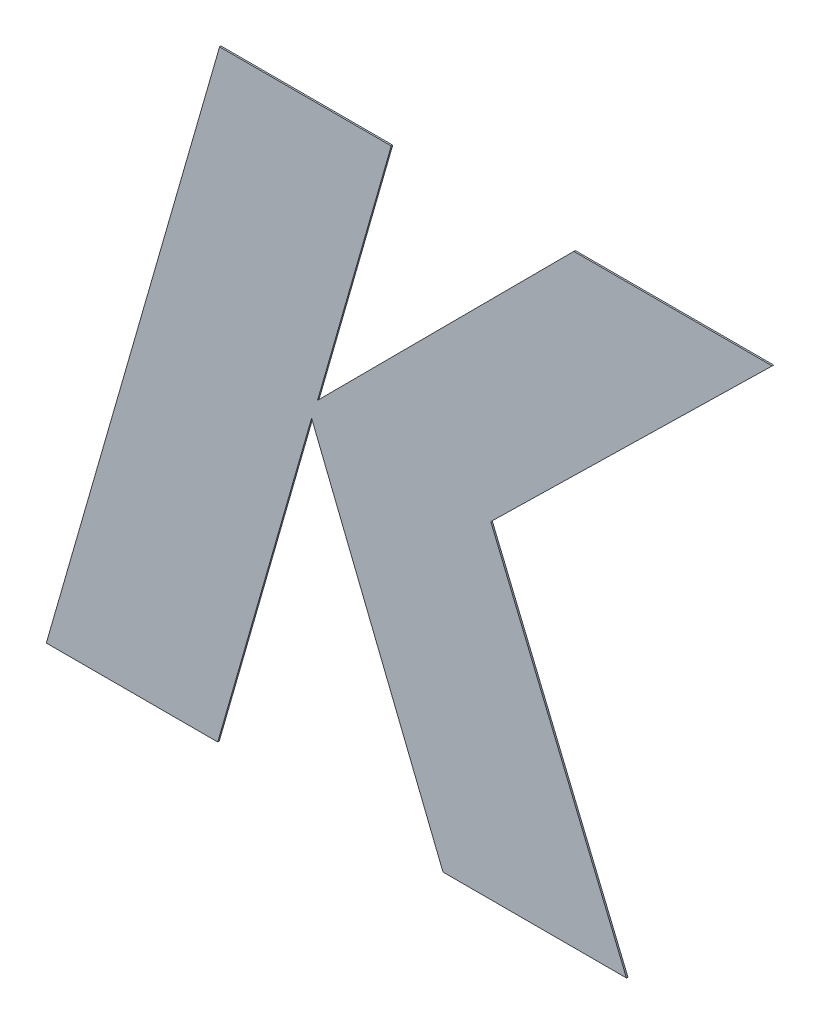
ISO-10303-21;
HEADER;
FILE_DESCRIPTION(('STEP AP214'),'2;1');
FILE_NAME('part.step','',(''),(''),'','','');
FILE_SCHEMA(('AUTOMOTIVE_DESIGN { 1 0 10303 214 1 1 1 1 }'));
ENDSEC;
DATA;
#1=APPLICATION_CONTEXT('core data for automotive mechanical design processes');
#2=APPLICATION_PROTOCOL_DEFINITION('international standard','automotive_design',2000,#1);
#3=PRODUCT_CONTEXT('',#1,'mechanical');
#4=PRODUCT('Part','Part','',(#3));
#5=PRODUCT_RELATED_PRODUCT_CATEGORY('part','',(#4));
#6=PRODUCT_DEFINITION_FORMATION('','',#4);
#7=PRODUCT_DEFINITION_CONTEXT('part definition',#1,'design');
#8=PRODUCT_DEFINITION('design','',#6,#7);
#9=PRODUCT_DEFINITION_SHAPE('','',#8);
#10=(LENGTH_UNIT() NAMED_UNIT(*) SI_UNIT(.MILLI.,.METRE.));
#11=(NAMED_UNIT(*) PLANE_ANGLE_UNIT() SI_UNIT($,.RADIAN.));
#12=(NAMED_UNIT(*) SI_UNIT($,.STERADIAN.) SOLID_ANGLE_UNIT());
#13=UNCERTAINTY_MEASURE_WITH_UNIT(LENGTH_MEASURE(1.E-05),#10,'distance_accuracy_value','');
#14=(GEOMETRIC_REPRESENTATION_CONTEXT(3) GLOBAL_UNCERTAINTY_ASSIGNED_CONTEXT((#13)) GLOBAL_UNIT_ASSIGNED_CONTEXT((#10,
#11,#12)) REPRESENTATION_CONTEXT('',''));
#15=CARTESIAN_POINT('',(0.,0.,0.));
#16=DIRECTION('',(0.,0.,1.));
#17=DIRECTION('',(1.,0.,0.));
#18=AXIS2_PLACEMENT_3D('',#15,#16,#17);
#19=CARTESIAN_POINT('',(3.91803,4.77633,5.205));
#20=DIRECTION('',(0.961099233431586,-0.276203301025201,0.));
#21=DIRECTION('',(0.,0.,-1.));
#22=AXIS2_PLACEMENT_3D('',#19,#20,#21);
#23=PLANE('',#22);
#24=DIRECTION('',(-0.276203301025201,-0.961099233431586,0.));
#25=VECTOR('',#24,1.);
#26=CARTESIAN_POINT('',(3.91803,4.77633,5.2));
#27=LINE('',#26,#25);
#28=CARTESIAN_POINT('',(4.5070939744564,6.82608440985244,5.2));
#29=VERTEX_POINT('',#28);
#30=CARTESIAN_POINT('',(3.91803,4.77633,5.2));
#31=VERTEX_POINT('',#30);
#32=EDGE_CURVE('E10',#29,#31,#27,.T.);
#33=ORIENTED_EDGE('',*,*,#32,.T.);
#34=DIRECTION('',(0.,0.,-1.));
#35=VECTOR('',#34,1.);
#36=CARTESIAN_POINT('',(3.91803,4.77633,5.205));
#37=LINE('',#36,#35);
#38=CARTESIAN_POINT('',(3.91803,4.77633,5.205));
#39=VERTEX_POINT('',#38);
#40=EDGE_CURVE('E42',#39,#31,#37,.T.);
#41=ORIENTED_EDGE('',*,*,#40,.F.);
#42=DIRECTION('',(-0.276203301025201,-0.961099233431586,0.));
#43=VECTOR('',#42,1.);
#44=CARTESIAN_POINT('',(3.91803,4.77633,5.205));
#45=LINE('',#44,#43);
#46=CARTESIAN_POINT('',(4.5070939744564,6.82608440985244,5.205));
#47=VERTEX_POINT('',#46);
#48=EDGE_CURVE('E135',#47,#39,#45,.T.);
#49=ORIENTED_EDGE('',*,*,#48,.F.);
#50=DIRECTION('',(0.,0.,-1.));
#51=VECTOR('',#50,1.);
#52=CARTESIAN_POINT('',(4.5070939744564,6.82608440985244,5.205));
#53=LINE('',#52,#51);
#54=EDGE_CURVE('E27',#47,#29,#53,.T.);
#55=ORIENTED_EDGE('',*,*,#54,.T.);
#56=EDGE_LOOP('',(#33,#41,#49,#55));
#57=FACE_BOUND('',#56,.T.);
#58=ADVANCED_FACE('F16',(#57),#23,.F.);
#59=CARTESIAN_POINT('',(4.50088641085166,4.77632999999994,5.205));
#60=DIRECTION('',(0.,1.,0.));
#61=DIRECTION('',(1.,0.,-1.10443527591038E-13));
#62=AXIS2_PLACEMENT_3D('',#59,#60,#61);
#63=PLANE('',#62);
#64=DIRECTION('',(1.,-1.10443527591038E-13,0.));
#65=VECTOR('',#64,1.);
#66=CARTESIAN_POINT('',(4.50088641085166,4.77632999999994,5.2));
#67=LINE('',#66,#65);
#68=CARTESIAN_POINT('',(4.50088641085166,4.77632999999994,5.2));
#69=VERTEX_POINT('',#68);
#70=EDGE_CURVE('E160',#31,#69,#67,.T.);
#71=ORIENTED_EDGE('',*,*,#70,.T.);
#72=DIRECTION('',(0.,0.,-1.));
#73=VECTOR('',#72,1.);
#74=CARTESIAN_POINT('',(4.50088641085166,4.77632999999994,5.205));
#75=LINE('',#74,#73);
#76=CARTESIAN_POINT('',(4.50088641085166,4.77632999999994,5.205));
#77=VERTEX_POINT('',#76);
#78=EDGE_CURVE('E149',#77,#69,#75,.T.);
#79=ORIENTED_EDGE('',*,*,#78,.F.);
#80=DIRECTION('',(1.,-1.10443527591038E-13,0.));
#81=VECTOR('',#80,1.);
#82=CARTESIAN_POINT('',(4.50088641085166,4.77632999999994,5.205));
#83=LINE('',#82,#81);
#84=EDGE_CURVE('E178',#39,#77,#83,.T.);
#85=ORIENTED_EDGE('',*,*,#84,.F.);
#86=ORIENTED_EDGE('',*,*,#40,.T.);
#87=EDGE_LOOP('',(#71,#79,#85,#86));
#88=FACE_BOUND('',#87,.T.);
#89=ADVANCED_FACE('F161',(#88),#63,.F.);
#90=CARTESIAN_POINT('',(4.81988404513849,5.88929101332706,5.205));
#91=DIRECTION('',(-0.961293454474758,0.275526576547503,0.));
#92=DIRECTION('',(0.,0.,1.));
#93=AXIS2_PLACEMENT_3D('',#90,#91,#92);
#94=PLANE('',#93);
#95=DIRECTION('',(0.275526576547503,0.961293454474758,0.));
#96=VECTOR('',#95,1.);
#97=CARTESIAN_POINT('',(4.81988404513849,5.88929101332706,5.2));
#98=LINE('',#97,#96);
#99=CARTESIAN_POINT('',(4.81988404513849,5.88929101332706,5.2));
#100=VERTEX_POINT('',#99);
#101=EDGE_CURVE('E153',#69,#100,#98,.T.);
#102=ORIENTED_EDGE('',*,*,#101,.T.);
#103=DIRECTION('',(0.,0.,-1.));
#104=VECTOR('',#103,1.);
#105=CARTESIAN_POINT('',(4.81988404513849,5.88929101332706,5.205));
#106=LINE('',#105,#104);
#107=CARTESIAN_POINT('',(4.81988404513849,5.88929101332706,5.205));
#108=VERTEX_POINT('',#107);
#109=EDGE_CURVE('E183',#108,#100,#106,.T.);
#110=ORIENTED_EDGE('',*,*,#109,.F.);
#111=DIRECTION('',(0.275526576547503,0.961293454474758,0.));
#112=VECTOR('',#111,1.);
#113=CARTESIAN_POINT('',(4.81988404513849,5.88929101332706,5.205));
#114=LINE('',#113,#112);
#115=EDGE_CURVE('E155',#77,#108,#114,.T.);
#116=ORIENTED_EDGE('',*,*,#115,.F.);
#117=ORIENTED_EDGE('',*,*,#78,.T.);
#118=EDGE_LOOP('',(#102,#110,#116,#117));
#119=FACE_BOUND('',#118,.T.);
#120=ADVANCED_FACE('F150',(#119),#94,.F.);
#121=CARTESIAN_POINT('',(5.26662283395568,4.77632999999994,5.205));
#122=DIRECTION('',(0.928029086213704,0.372507738364397,0.));
#123=DIRECTION('',(0.,0.,-1.));
#124=AXIS2_PLACEMENT_3D('',#121,#122,#123);
#125=PLANE('',#124);
#126=DIRECTION('',(0.372507738364397,-0.928029086213704,0.));
#127=VECTOR('',#126,1.);
#128=CARTESIAN_POINT('',(5.26662283395568,4.77632999999994,5.2));
#129=LINE('',#128,#127);
#130=CARTESIAN_POINT('',(5.26662283395568,4.77632999999994,5.2));
#131=VERTEX_POINT('',#130);
#132=EDGE_CURVE('E157',#100,#131,#129,.T.);
#133=ORIENTED_EDGE('',*,*,#132,.T.);
#134=DIRECTION('',(0.,0.,-1.));
#135=VECTOR('',#134,1.);
#136=CARTESIAN_POINT('',(5.26662283395568,4.77632999999994,5.205));
#137=LINE('',#136,#135);
#138=CARTESIAN_POINT('',(5.26662283395568,4.77632999999994,5.205));
#139=VERTEX_POINT('',#138);
#140=EDGE_CURVE('E184',#139,#131,#137,.T.);
#141=ORIENTED_EDGE('',*,*,#140,.F.);
#142=DIRECTION('',(0.372507738364397,-0.928029086213704,0.));
#143=VECTOR('',#142,1.);
#144=CARTESIAN_POINT('',(5.26662283395568,4.77632999999994,5.205));
#145=LINE('',#144,#143);
#146=EDGE_CURVE('E201',#108,#139,#145,.T.);
#147=ORIENTED_EDGE('',*,*,#146,.F.);
#148=ORIENTED_EDGE('',*,*,#109,.T.);
#149=EDGE_LOOP('',(#133,#141,#147,#148));
#150=FACE_BOUND('',#149,.T.);
#151=ADVANCED_FACE('F268',(#150),#125,.F.);
#152=CARTESIAN_POINT('',(5.89029583608144,4.77632999999994,5.205));
#153=DIRECTION('',(0.,1.,0.));
#154=DIRECTION('',(1.,0.,0.));
#155=AXIS2_PLACEMENT_3D('',#152,#153,#154);
#156=PLANE('',#155);
#157=DIRECTION('',(1.,0.,0.));
#158=VECTOR('',#157,1.);
#159=CARTESIAN_POINT('',(5.89029583608144,4.77632999999994,5.2));
#160=LINE('',#159,#158);
#161=CARTESIAN_POINT('',(5.89029583608144,4.77632999999994,5.2));
#162=VERTEX_POINT('',#161);
#163=EDGE_CURVE('E180',#131,#162,#160,.T.);
#164=ORIENTED_EDGE('',*,*,#163,.T.);
#165=DIRECTION('',(0.,0.,-1.));
#166=VECTOR('',#165,1.);
#167=CARTESIAN_POINT('',(5.89029583608144,4.77632999999994,5.205));
#168=LINE('',#167,#166);
#169=CARTESIAN_POINT('',(5.89029583608144,4.77632999999994,5.205));
#170=VERTEX_POINT('',#169);
#171=EDGE_CURVE('E226',#170,#162,#168,.T.);
#172=ORIENTED_EDGE('',*,*,#171,.F.);
#173=DIRECTION('',(1.,0.,0.));
#174=VECTOR('',#173,1.);
#175=CARTESIAN_POINT('',(5.89029583608144,4.77632999999994,5.205));
#176=LINE('',#175,#174);
#177=EDGE_CURVE('E198',#139,#170,#176,.T.);
#178=ORIENTED_EDGE('',*,*,#177,.F.);
#179=ORIENTED_EDGE('',*,*,#140,.T.);
#180=EDGE_LOOP('',(#164,#172,#178,#179));
#181=FACE_BOUND('',#180,.T.);
#182=ADVANCED_FACE('F18',(#181),#156,.F.);
#183=CARTESIAN_POINT('',(5.42896678366348,5.88929101332707,5.205));
#184=DIRECTION('',(-0.923783981403877,-0.382914031737676,0.));
#185=DIRECTION('',(-0.382914031737676,0.923783981403877,0.));
#186=AXIS2_PLACEMENT_3D('',#183,#184,#185);
#187=PLANE('',#186);
#188=DIRECTION('',(-0.382914031737676,0.923783981403877,0.));
#189=VECTOR('',#188,1.);
#190=CARTESIAN_POINT('',(5.42896678366348,5.88929101332707,5.2));
#191=LINE('',#190,#189);
#192=CARTESIAN_POINT('',(5.42896678366348,5.88929101332707,5.2));
#193=VERTEX_POINT('',#192);
#194=EDGE_CURVE('E197',#162,#193,#191,.T.);
#195=ORIENTED_EDGE('',*,*,#194,.T.);
#196=DIRECTION('',(0.,0.,-1.));
#197=VECTOR('',#196,1.);
#198=CARTESIAN_POINT('',(5.42896678366348,5.88929101332707,5.205));
#199=LINE('',#198,#197);
#200=CARTESIAN_POINT('',(5.42896678366348,5.88929101332707,5.205));
#201=VERTEX_POINT('',#200);
#202=EDGE_CURVE('E188',#201,#193,#199,.T.);
#203=ORIENTED_EDGE('',*,*,#202,.F.);
#204=DIRECTION('',(-0.382914031737676,0.923783981403877,0.));
#205=VECTOR('',#204,1.);
#206=CARTESIAN_POINT('',(5.42896678366348,5.88929101332707,5.205));
#207=LINE('',#206,#205);
#208=EDGE_CURVE('E108',#170,#201,#207,.T.);
#209=ORIENTED_EDGE('',*,*,#208,.F.);
#210=ORIENTED_EDGE('',*,*,#171,.T.);
#211=EDGE_LOOP('',(#195,#203,#209,#210));
#212=FACE_BOUND('',#211,.T.);
#213=ADVANCED_FACE('F376',(#212),#187,.F.);
#214=CARTESIAN_POINT('',(6.38585373580663,6.82608440985244,5.205));
#215=DIRECTION('',(-0.699564397226959,0.714569558638263,0.));
#216=DIRECTION('',(0.,0.,1.));
#217=AXIS2_PLACEMENT_3D('',#214,#215,#216);
#218=PLANE('',#217);
#219=DIRECTION('',(0.714569558638263,0.699564397226959,0.));
#220=VECTOR('',#219,1.);
#221=CARTESIAN_POINT('',(6.38585373580663,6.82608440985244,5.2));
#222=LINE('',#221,#220);
#223=CARTESIAN_POINT('',(6.38585373580663,6.82608440985244,5.2));
#224=VERTEX_POINT('',#223);
#225=EDGE_CURVE('E229',#193,#224,#222,.T.);
#226=ORIENTED_EDGE('',*,*,#225,.T.);
#227=DIRECTION('',(0.,0.,-1.));
#228=VECTOR('',#227,1.);
#229=CARTESIAN_POINT('',(6.38585373580663,6.82608440985244,5.205));
#230=LINE('',#229,#228);
#231=CARTESIAN_POINT('',(6.38585373580663,6.82608440985244,5.205));
#232=VERTEX_POINT('',#231);
#233=EDGE_CURVE('E123',#232,#224,#230,.T.);
#234=ORIENTED_EDGE('',*,*,#233,.F.);
#235=DIRECTION('',(0.714569558638263,0.699564397226959,0.));
#236=VECTOR('',#235,1.);
#237=CARTESIAN_POINT('',(6.38585373580663,6.82608440985244,5.205));
#238=LINE('',#237,#236);
#239=EDGE_CURVE('E20',#201,#232,#238,.T.);
#240=ORIENTED_EDGE('',*,*,#239,.F.);
#241=ORIENTED_EDGE('',*,*,#202,.T.);
#242=EDGE_LOOP('',(#226,#234,#240,#241));
#243=FACE_BOUND('',#242,.T.);
#244=ADVANCED_FACE('F371',(#243),#218,.F.);
#245=CARTESIAN_POINT('',(5.71129866959105,6.82608440985244,5.205));
#246=DIRECTION('',(0.,-1.,0.));
#247=DIRECTION('',(0.,0.,-1.));
#248=AXIS2_PLACEMENT_3D('',#245,#246,#247);
#249=PLANE('',#248);
#250=DIRECTION('',(-1.,0.,0.));
#251=VECTOR('',#250,1.);
#252=CARTESIAN_POINT('',(5.71129866959105,6.82608440985244,5.2));
#253=LINE('',#252,#251);
#254=CARTESIAN_POINT('',(5.71129866959105,6.82608440985244,5.2));
#255=VERTEX_POINT('',#254);
#256=EDGE_CURVE('E185',#224,#255,#253,.T.);
#257=ORIENTED_EDGE('',*,*,#256,.T.);
#258=DIRECTION('',(0.,0.,-1.));
#259=VECTOR('',#258,1.);
#260=CARTESIAN_POINT('',(5.71129866959105,6.82608440985244,5.205));
#261=LINE('',#260,#259);
#262=CARTESIAN_POINT('',(5.71129866959105,6.82608440985244,5.205));
#263=VERTEX_POINT('',#262);
#264=EDGE_CURVE('E222',#263,#255,#261,.T.);
#265=ORIENTED_EDGE('',*,*,#264,.F.);
#266=DIRECTION('',(-1.,0.,0.));
#267=VECTOR('',#266,1.);
#268=CARTESIAN_POINT('',(5.71129866959105,6.82608440985244,5.205));
#269=LINE('',#268,#267);
#270=EDGE_CURVE('E205',#232,#263,#269,.T.);
#271=ORIENTED_EDGE('',*,*,#270,.F.);
#272=ORIENTED_EDGE('',*,*,#233,.T.);
#273=EDGE_LOOP('',(#257,#265,#271,#272));
#274=FACE_BOUND('',#273,.T.);
#275=ADVANCED_FACE('F375',(#274),#249,.F.);
#276=CARTESIAN_POINT('',(4.84017080800069,5.95198988211872,5.205));
#277=DIRECTION('',(0.708307753494397,-0.70590376563645,0.));
#278=DIRECTION('',(0.,0.,-1.));
#279=AXIS2_PLACEMENT_3D('',#276,#277,#278);
#280=PLANE('',#279);
#281=DIRECTION('',(-0.70590376563645,-0.708307753494397,0.));
#282=VECTOR('',#281,1.);
#283=CARTESIAN_POINT('',(4.84017080800069,5.95198988211872,5.2));
#284=LINE('',#283,#282);
#285=CARTESIAN_POINT('',(4.84017080800069,5.95198988211872,5.2));
#286=VERTEX_POINT('',#285);
#287=EDGE_CURVE('E204',#255,#286,#284,.T.);
#288=ORIENTED_EDGE('',*,*,#287,.T.);
#289=DIRECTION('',(0.,0.,-1.));
#290=VECTOR('',#289,1.);
#291=CARTESIAN_POINT('',(4.84017080800069,5.95198988211872,5.205));
#292=LINE('',#291,#290);
#293=CARTESIAN_POINT('',(4.84017080800069,5.95198988211872,5.205));
#294=VERTEX_POINT('',#293);
#295=EDGE_CURVE('E212',#294,#286,#292,.T.);
#296=ORIENTED_EDGE('',*,*,#295,.F.);
#297=DIRECTION('',(-0.70590376563645,-0.708307753494397,0.));
#298=VECTOR('',#297,1.);
#299=CARTESIAN_POINT('',(4.84017080800069,5.95198988211872,5.205));
#300=LINE('',#299,#298);
#301=EDGE_CURVE('E193',#263,#294,#300,.T.);
#302=ORIENTED_EDGE('',*,*,#301,.F.);
#303=ORIENTED_EDGE('',*,*,#264,.T.);
#304=EDGE_LOOP('',(#288,#296,#302,#303));
#305=FACE_BOUND('',#304,.T.);
#306=ADVANCED_FACE('F392',(#305),#280,.F.);
#307=CARTESIAN_POINT('',(5.09072944844473,6.82608440985244,5.205));
#308=DIRECTION('',(-0.961286149092731,0.27555206325206,0.));
#309=DIRECTION('',(0.,0.,1.));
#310=AXIS2_PLACEMENT_3D('',#307,#308,#309);
#311=PLANE('',#310);
#312=DIRECTION('',(0.27555206325206,0.961286149092731,0.));
#313=VECTOR('',#312,1.);
#314=CARTESIAN_POINT('',(5.09072944844473,6.82608440985244,5.2));
#315=LINE('',#314,#313);
#316=CARTESIAN_POINT('',(5.09072944844473,6.82608440985244,5.2));
#317=VERTEX_POINT('',#316);
#318=EDGE_CURVE('E215',#286,#317,#315,.T.);
#319=ORIENTED_EDGE('',*,*,#318,.T.);
#320=DIRECTION('',(0.,0.,-1.));
#321=VECTOR('',#320,1.);
#322=CARTESIAN_POINT('',(5.09072944844473,6.82608440985244,5.205));
#323=LINE('',#322,#321);
#324=CARTESIAN_POINT('',(5.09072944844473,6.82608440985244,5.205));
#325=VERTEX_POINT('',#324);
#326=EDGE_CURVE('E232',#325,#317,#323,.T.);
#327=ORIENTED_EDGE('',*,*,#326,.F.);
#328=DIRECTION('',(0.27555206325206,0.961286149092731,0.));
#329=VECTOR('',#328,1.);
#330=CARTESIAN_POINT('',(5.09072944844473,6.82608440985244,5.205));
#331=LINE('',#330,#329);
#332=EDGE_CURVE('E189',#294,#325,#331,.T.);
#333=ORIENTED_EDGE('',*,*,#332,.F.);
#334=ORIENTED_EDGE('',*,*,#295,.T.);
#335=EDGE_LOOP('',(#319,#327,#333,#334));
#336=FACE_BOUND('',#335,.T.);
#337=ADVANCED_FACE('F407',(#336),#311,.F.);
#338=CARTESIAN_POINT('',(4.5070939744564,6.82608440985244,5.205));
#339=DIRECTION('',(0.,-1.,0.));
#340=DIRECTION('',(0.,0.,-1.));
#341=AXIS2_PLACEMENT_3D('',#338,#339,#340);
#342=PLANE('',#341);
#343=DIRECTION('',(-1.,0.,0.));
#344=VECTOR('',#343,1.);
#345=CARTESIAN_POINT('',(4.5070939744564,6.82608440985244,5.2));
#346=LINE('',#345,#344);
#347=EDGE_CURVE('E216',#317,#29,#346,.T.);
#348=ORIENTED_EDGE('',*,*,#347,.T.);
#349=ORIENTED_EDGE('',*,*,#54,.F.);
#350=DIRECTION('',(-1.,0.,0.));
#351=VECTOR('',#350,1.);
#352=CARTESIAN_POINT('',(4.5070939744564,6.82608440985244,5.205));
#353=LINE('',#352,#351);
#354=EDGE_CURVE('E194',#325,#47,#353,.T.);
#355=ORIENTED_EDGE('',*,*,#354,.F.);
#356=ORIENTED_EDGE('',*,*,#326,.T.);
#357=EDGE_LOOP('',(#348,#349,#355,#356));
#358=FACE_BOUND('',#357,.T.);
#359=ADVANCED_FACE('F413',(#358),#342,.F.);
#360=CARTESIAN_POINT('',(-0.222484440430861,-1.85805867567166,5.205));
#361=DIRECTION('',(0.,0.,-1.));
#362=DIRECTION('',(0.,-1.,0.));
#363=AXIS2_PLACEMENT_3D('',#360,#361,#362);
#364=PLANE('',#363);
#365=ORIENTED_EDGE('',*,*,#48,.T.);
#366=ORIENTED_EDGE('',*,*,#84,.T.);
#367=ORIENTED_EDGE('',*,*,#115,.T.);
#368=ORIENTED_EDGE('',*,*,#146,.T.);
#369=ORIENTED_EDGE('',*,*,#177,.T.);
#370=ORIENTED_EDGE('',*,*,#208,.T.);
#371=ORIENTED_EDGE('',*,*,#239,.T.);
#372=ORIENTED_EDGE('',*,*,#270,.T.);
#373=ORIENTED_EDGE('',*,*,#301,.T.);
#374=ORIENTED_EDGE('',*,*,#332,.T.);
#375=ORIENTED_EDGE('',*,*,#354,.T.);
#376=EDGE_LOOP('',(#365,#366,#367,#368,#369,#370,#371,#372,#373,#374,#375));
#377=FACE_BOUND('',#376,.T.);
#378=ADVANCED_FACE('F275',(#377),#364,.F.);
#379=CARTESIAN_POINT('',(-0.222484440430861,-1.85805867567166,5.2));
#380=DIRECTION('',(0.,0.,-1.));
#381=DIRECTION('',(0.,-1.,0.));
#382=AXIS2_PLACEMENT_3D('',#379,#380,#381);
#383=PLANE('',#382);
#384=ORIENTED_EDGE('',*,*,#32,.F.);
#385=ORIENTED_EDGE('',*,*,#347,.F.);
#386=ORIENTED_EDGE('',*,*,#318,.F.);
#387=ORIENTED_EDGE('',*,*,#287,.F.);
#388=ORIENTED_EDGE('',*,*,#256,.F.);
#389=ORIENTED_EDGE('',*,*,#225,.F.);
#390=ORIENTED_EDGE('',*,*,#194,.F.);
#391=ORIENTED_EDGE('',*,*,#163,.F.);
#392=ORIENTED_EDGE('',*,*,#132,.F.);
#393=ORIENTED_EDGE('',*,*,#101,.F.);
#394=ORIENTED_EDGE('',*,*,#70,.F.);
#395=EDGE_LOOP('',(#384,#385,#386,#387,#388,#389,#390,#391,#392,#393,#394));
#396=FACE_BOUND('',#395,.T.);
#397=ADVANCED_FACE('F165',(#396),#383,.T.);
#398=CLOSED_SHELL('',(#58,#89,#120,#151,#182,#213,#244,#275,#306,#337,#359,#378,#397));
#399=MANIFOLD_SOLID_BREP('B1',#398);
#400=ADVANCED_BREP_SHAPE_REPRESENTATION('',(#18,#399),#14);
#401=SHAPE_DEFINITION_REPRESENTATION(#9,#400);
ENDSEC;
END-ISO-10303-21;
